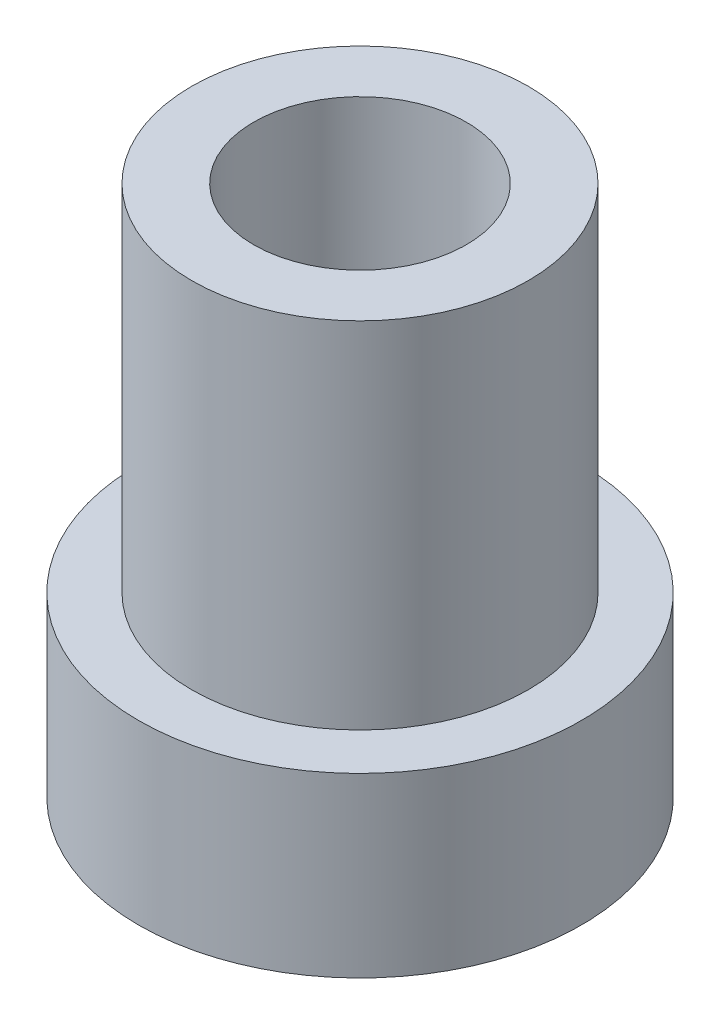
ISO-10303-21;
HEADER;
FILE_DESCRIPTION(('STEP AP214'),'2;1');
FILE_NAME('part.step','',(''),(''),'','','');
FILE_SCHEMA(('AUTOMOTIVE_DESIGN { 1 0 10303 214 1 1 1 1 }'));
ENDSEC;
DATA;
#1=APPLICATION_CONTEXT('core data for automotive mechanical design processes');
#2=APPLICATION_PROTOCOL_DEFINITION('international standard','automotive_design',2000,#1);
#3=PRODUCT_CONTEXT('',#1,'mechanical');
#4=PRODUCT('Part','Part','',(#3));
#5=PRODUCT_RELATED_PRODUCT_CATEGORY('part','',(#4));
#6=PRODUCT_DEFINITION_FORMATION('','',#4);
#7=PRODUCT_DEFINITION_CONTEXT('part definition',#1,'design');
#8=PRODUCT_DEFINITION('design','',#6,#7);
#9=PRODUCT_DEFINITION_SHAPE('','',#8);
#10=(LENGTH_UNIT() NAMED_UNIT(*) SI_UNIT(.MILLI.,.METRE.));
#11=(NAMED_UNIT(*) PLANE_ANGLE_UNIT() SI_UNIT($,.RADIAN.));
#12=(NAMED_UNIT(*) SI_UNIT($,.STERADIAN.) SOLID_ANGLE_UNIT());
#13=UNCERTAINTY_MEASURE_WITH_UNIT(LENGTH_MEASURE(1.E-05),#10,'distance_accuracy_value','');
#14=(GEOMETRIC_REPRESENTATION_CONTEXT(3) GLOBAL_UNCERTAINTY_ASSIGNED_CONTEXT((#13)) GLOBAL_UNIT_ASSIGNED_CONTEXT((#10,
#11,#12)) REPRESENTATION_CONTEXT('',''));
#15=CARTESIAN_POINT('',(0.,0.,0.));
#16=DIRECTION('',(0.,0.,1.));
#17=DIRECTION('',(1.,0.,0.));
#18=AXIS2_PLACEMENT_3D('',#15,#16,#17);
#19=CARTESIAN_POINT('',(0.,2.5,0.));
#20=DIRECTION('',(0.,1.,0.));
#21=DIRECTION('',(0.,0.,1.));
#22=AXIS2_PLACEMENT_3D('',#19,#20,#21);
#23=PLANE('',#22);
#24=CARTESIAN_POINT('',(0.,2.5,0.));
#25=DIRECTION('',(0.,1.,0.));
#26=DIRECTION('',(0.,0.,1.));
#27=AXIS2_PLACEMENT_3D('',#24,#25,#26);
#28=CIRCLE('',#27,6.25);
#29=CARTESIAN_POINT('',(0.,2.5,6.25));
#30=VERTEX_POINT('',#29);
#31=EDGE_CURVE('E98',#30,#30,#28,.T.);
#32=ORIENTED_EDGE('',*,*,#31,.T.);
#33=EDGE_LOOP('',(#32));
#34=FACE_BOUND('',#33,.T.);
#35=CARTESIAN_POINT('',(0.,2.5,0.));
#36=DIRECTION('',(0.,1.,0.));
#37=DIRECTION('',(0.,0.,1.));
#38=AXIS2_PLACEMENT_3D('',#35,#36,#37);
#39=CIRCLE('',#38,4.75);
#40=CARTESIAN_POINT('',(0.,2.5,4.75));
#41=VERTEX_POINT('',#40);
#42=EDGE_CURVE('E101',#41,#41,#39,.T.);
#43=ORIENTED_EDGE('',*,*,#42,.F.);
#44=EDGE_LOOP('',(#43));
#45=FACE_BOUND('',#44,.T.);
#46=ADVANCED_FACE('F31',(#34,#45),#23,.T.);
#47=CARTESIAN_POINT('',(0.,-2.5,0.));
#48=DIRECTION('',(0.,1.,0.));
#49=DIRECTION('',(0.,0.,1.));
#50=AXIS2_PLACEMENT_3D('',#47,#48,#49);
#51=CYLINDRICAL_SURFACE('',#50,6.25);
#52=CARTESIAN_POINT('',(-0.799999999999998,0.,-6.19858854901662));
#53=CARTESIAN_POINT('',(-0.799998103355052,0.0447384216622826,-6.19858920509883));
#54=CARTESIAN_POINT('',(-0.796234471583089,0.0895045855043547,-6.19907813068979));
#55=CARTESIAN_POINT('',(-0.781280467250262,0.177790427744555,-6.20098020115156));
#56=CARTESIAN_POINT('',(-0.770082391166254,0.221308764306667,-6.20239430466362));
#57=CARTESIAN_POINT('',(-0.740595585422706,0.305807971281473,-6.20598399602033));
#58=CARTESIAN_POINT('',(-0.722311737644266,0.346790566247948,-6.20815905948661));
#59=CARTESIAN_POINT('',(-0.679182972751172,0.425098400276179,-6.21302496530502));
#60=CARTESIAN_POINT('',(-0.654339152977227,0.46242424960159,-6.21571572137237));
#61=CARTESIAN_POINT('',(-0.598639726638125,0.532585288349308,-6.22132749335143));
#62=CARTESIAN_POINT('',(-0.56775332015891,0.565395938553753,-6.22424964125099));
#63=CARTESIAN_POINT('',(-0.500911802489199,0.625383157520279,-6.22998477347367));
#64=CARTESIAN_POINT('',(-0.464956436446921,0.652559442833896,-6.23279775229903));
#65=CARTESIAN_POINT('',(-0.388843043981081,0.700594824202452,-6.23800921634215));
#66=CARTESIAN_POINT('',(-0.348670862502126,0.721431664551834,-6.24040622887381));
#67=CARTESIAN_POINT('',(-0.265361571195449,0.756054095238485,-6.24450322898534));
#68=CARTESIAN_POINT('',(-0.222224576605874,0.769839959461727,-6.24620324363866));
#69=CARTESIAN_POINT('',(-0.134461363552115,0.78989565965155,-6.2487067283774));
#70=CARTESIAN_POINT('',(-0.0898446184998568,0.796206333423712,-6.24951506809975));
#71=CARTESIAN_POINT('',(-0.000178563831103555,0.801259104905367,-6.25016076076463));
#72=CARTESIAN_POINT('',(0.0448707279131788,0.80000151399262,-6.2499981536544));
#73=CARTESIAN_POINT('',(0.133845159087812,0.78998612710476,-6.24872420865018));
#74=CARTESIAN_POINT('',(0.177775333300913,0.781272252772466,-6.24761842670037));
#75=CARTESIAN_POINT('',(0.26354465032002,0.756660343950103,-6.24458861098289));
#76=CARTESIAN_POINT('',(0.305383751732842,0.740762167307911,-6.24266456102461));
#77=CARTESIAN_POINT('',(0.385918901333397,0.702186431235864,-6.23820482636099));
#78=CARTESIAN_POINT('',(0.424605774331072,0.679489921838115,-6.23566743587015));
#79=CARTESIAN_POINT('',(0.49763820524263,0.627975581400759,-6.23026478130117));
#80=CARTESIAN_POINT('',(0.53198355429771,0.599157456045633,-6.22739950146179));
#81=CARTESIAN_POINT('',(0.595616134646156,0.535972070643326,-6.22163736995005));
#82=CARTESIAN_POINT('',(0.624865354771136,0.501566524418464,-6.21874043917224));
#83=CARTESIAN_POINT('',(0.677179822101734,0.42831430524855,-6.2132617470842));
#84=CARTESIAN_POINT('',(0.700245048185655,0.389467617135233,-6.21067998685047));
#85=CARTESIAN_POINT('',(0.739539289986804,0.308401324610993,-6.20612399249395));
#86=CARTESIAN_POINT('',(0.755765165574465,0.266180181456947,-6.20415003754274));
#87=CARTESIAN_POINT('',(0.780885905649601,0.17958150973,-6.20103853372848));
#88=CARTESIAN_POINT('',(0.789781141229998,0.135204090432929,-6.19990094252718));
#89=CARTESIAN_POINT('',(0.799937560637435,0.0458885645932327,-6.19859874267202));
#90=CARTESIAN_POINT('',(0.80125228095606,0.000956641635407121,-6.19842731082682));
#91=CARTESIAN_POINT('',(0.796351695747611,-0.0884868285649509,-6.19905878667995));
#92=CARTESIAN_POINT('',(0.790136558721648,-0.132998385191864,-6.19986167257526));
#93=CARTESIAN_POINT('',(0.770397797314314,-0.220176568162875,-6.20234508806591));
#94=CARTESIAN_POINT('',(0.756900179018527,-0.262849179440258,-6.20402249399469));
#95=CARTESIAN_POINT('',(0.723006404263422,-0.345325552666033,-6.20806341076657));
#96=CARTESIAN_POINT('',(0.702609994319167,-0.385129209134123,-6.21042694681996));
#97=CARTESIAN_POINT('',(0.655366319104514,-0.460979763177237,-6.21559012728318));
#98=CARTESIAN_POINT('',(0.628483995817668,-0.497004662895021,-6.21839211165469));
#99=CARTESIAN_POINT('',(0.569081051422917,-0.564050452374765,-6.22410916255449));
#100=CARTESIAN_POINT('',(0.536560200123168,-0.595071137740769,-6.22702423369575));
#101=CARTESIAN_POINT('',(0.466569266179765,-0.651416465040394,-6.23266000344565));
#102=CARTESIAN_POINT('',(0.429070719390191,-0.676705894473667,-6.23537943391895));
#103=CARTESIAN_POINT('',(0.350326980977994,-0.720627002393255,-6.24029847252802));
#104=CARTESIAN_POINT('',(0.309081868017037,-0.739258820620069,-6.24249809157409));
#105=CARTESIAN_POINT('',(0.224132017906611,-0.769277877112732,-6.24612404918944));
#106=CARTESIAN_POINT('',(0.180434524800401,-0.780685343630966,-6.24755254523759));
#107=CARTESIAN_POINT('',(0.0917248691272082,-0.795997650606327,-6.24948427412541));
#108=CARTESIAN_POINT('',(0.046712768973737,-0.799902846662313,-6.24998755081937));
#109=CARTESIAN_POINT('',(-0.0430048083926901,-0.800092888538515,-6.25001190319));
#110=CARTESIAN_POINT('',(-0.0877101784763456,-0.796431983214026,-6.24953997110546));
#111=CARTESIAN_POINT('',(-0.17586465917414,-0.781708791545258,-6.24768085214323));
#112=CARTESIAN_POINT('',(-0.219313770963546,-0.770646512125421,-6.24629366612181));
#113=CARTESIAN_POINT('',(-0.303714392005289,-0.741451877837967,-6.24275920188162));
#114=CARTESIAN_POINT('',(-0.344666858289615,-0.723322252033565,-6.24061221708941));
#115=CARTESIAN_POINT('',(-0.422956789361968,-0.680513185462864,-6.23579567687036));
#116=CARTESIAN_POINT('',(-0.460294202731866,-0.655833651553664,-6.23312611401235));
#117=CARTESIAN_POINT('',(-0.53057111333578,-0.600425087547363,-6.22753943854455));
#118=CARTESIAN_POINT('',(-0.563478682462198,-0.569655717781125,-6.22462075331536));
#119=CARTESIAN_POINT('',(-0.623684422036376,-0.503024925894422,-6.21887729846471));
#120=CARTESIAN_POINT('',(-0.65098126374913,-0.467162300979386,-6.21605255122213));
#121=CARTESIAN_POINT('',(-0.699285837169648,-0.391195896147679,-6.21080460500523));
#122=CARTESIAN_POINT('',(-0.720267663867247,-0.35107553605646,-6.20838307774624));
#123=CARTESIAN_POINT('',(-0.755165924534618,-0.267871742201827,-6.20423533001094));
#124=CARTESIAN_POINT('',(-0.769090004253182,-0.22479157255845,-6.2025083575353));
#125=CARTESIAN_POINT('',(-0.786162981242654,-0.15124293526623,-6.20036235008673));
#126=CARTESIAN_POINT('',(-0.791344349660192,-0.121237413020004,-6.19970051072003));
#127=CARTESIAN_POINT('',(-0.798263489871271,-0.0608255335134214,-6.19881338890895));
#128=CARTESIAN_POINT('',(-0.800001289593617,-0.0304191795059932,-6.19858810292394));
#129=CARTESIAN_POINT('',(-0.799999999999998,0.,-6.19858854901662));
#130=B_SPLINE_CURVE_WITH_KNOTS('',3,(#52,#53,#54,#55,#56,#57,#58,#59,#60,#61,#62,#63,#64,#65,
#66,#67,#68,#69,#70,#71,#72,#73,#74,#75,#76,#77,#78,#79,#80,#81,#82,#83,#84,#85,#86,#87,#88,#89,
#90,#91,#92,#93,#94,#95,#96,#97,#98,#99,#100,#101,#102,#103,#104,#105,#106,#107,#108,#109,#110,
#111,#112,#113,#114,#115,#116,#117,#118,#119,#120,#121,#122,#123,#124,#125,#126,#127,#128,#129),
.UNSPECIFIED.,.T.,.F.,(4,2,2,2,2,2,2,2,2,2,2,2,2,2,2,2,2,2,2,2,2,2,2,2,2,2,2,2,2,2,2,2,2,2,2,2,
2,2,4),(0.,0.134104132368558,0.268347439905362,0.402498421845213,0.536626977442864,
0.671457907324828,0.806295618512648,0.941601378879694,1.07690188307166,1.21145976537299,
1.34601211165683,1.47977728364873,1.61354510249969,1.74768931751825,1.88183998339294,
2.01695199733597,2.15206447275403,2.28723891454726,2.4224065130962,2.55661832598568,
2.69082713557497,2.82455982096353,2.95829742067709,3.092774772505,3.22725761563873,
3.36254557159521,3.49783068774678,3.63273530973733,3.76763353724853,3.90156790235245,
4.03550214215267,4.16938471425588,4.30326919033684,4.43807214989299,4.57290699685859,
4.70828764282704,4.84352131404857,4.93470402924072,5.02588600489933),.UNSPECIFIED.);
#131=CARTESIAN_POINT('',(-0.799999999999998,0.,-6.19858854901662));
#132=VERTEX_POINT('',#131);
#133=EDGE_CURVE('E72',#132,#132,#130,.T.);
#134=ORIENTED_EDGE('',*,*,#133,.F.);
#135=EDGE_LOOP('',(#134));
#136=FACE_BOUND('',#135,.T.);
#137=CARTESIAN_POINT('',(-6.19858854901662,0.,0.799999999999998));
#138=CARTESIAN_POINT('',(-6.19858920509883,0.0447384216622826,0.799998103355052));
#139=CARTESIAN_POINT('',(-6.19907813068979,0.0895045855043546,0.796234471583089));
#140=CARTESIAN_POINT('',(-6.20098020115156,0.177790427744555,0.781280467250262));
#141=CARTESIAN_POINT('',(-6.20239430466362,0.221308764306667,0.770082391166254));
#142=CARTESIAN_POINT('',(-6.20598399602033,0.305807971281473,0.740595585422706));
#143=CARTESIAN_POINT('',(-6.20815905948661,0.346790566247948,0.722311737644266));
#144=CARTESIAN_POINT('',(-6.21302496530502,0.425098400276179,0.679182972751172));
#145=CARTESIAN_POINT('',(-6.21571572137237,0.46242424960159,0.654339152977227));
#146=CARTESIAN_POINT('',(-6.22132749335143,0.532585288349308,0.598639726638125));
#147=CARTESIAN_POINT('',(-6.22424964125099,0.565395938553753,0.56775332015891));
#148=CARTESIAN_POINT('',(-6.22998477347367,0.625383157520279,0.500911802489199));
#149=CARTESIAN_POINT('',(-6.23279775229903,0.652559442833896,0.464956436446921));
#150=CARTESIAN_POINT('',(-6.23800921634215,0.700594824202452,0.388843043981081));
#151=CARTESIAN_POINT('',(-6.24040622887381,0.721431664551834,0.348670862502126));
#152=CARTESIAN_POINT('',(-6.24450322898534,0.756054095238485,0.265361571195449));
#153=CARTESIAN_POINT('',(-6.24620324363866,0.769839959461727,0.222224576605874));
#154=CARTESIAN_POINT('',(-6.2487067283774,0.78989565965155,0.134461363552115));
#155=CARTESIAN_POINT('',(-6.24951506809975,0.796206333423712,0.0898446184998568));
#156=CARTESIAN_POINT('',(-6.25016076076463,0.801259104905367,0.000178563831103555));
#157=CARTESIAN_POINT('',(-6.2499981536544,0.80000151399262,-0.0448707279131788));
#158=CARTESIAN_POINT('',(-6.24872420865018,0.78998612710476,-0.133845159087812));
#159=CARTESIAN_POINT('',(-6.24761842670037,0.781272252772466,-0.177775333300913));
#160=CARTESIAN_POINT('',(-6.24458861098289,0.756660343950103,-0.26354465032002));
#161=CARTESIAN_POINT('',(-6.24266456102461,0.740762167307911,-0.305383751732842));
#162=CARTESIAN_POINT('',(-6.23820482636099,0.702186431235864,-0.385918901333397));
#163=CARTESIAN_POINT('',(-6.23566743587015,0.679489921838115,-0.424605774331072));
#164=CARTESIAN_POINT('',(-6.23026478130117,0.627975581400759,-0.49763820524263));
#165=CARTESIAN_POINT('',(-6.22739950146179,0.599157456045633,-0.53198355429771));
#166=CARTESIAN_POINT('',(-6.22163736995005,0.535972070643326,-0.595616134646156));
#167=CARTESIAN_POINT('',(-6.21874043917224,0.501566524418464,-0.624865354771136));
#168=CARTESIAN_POINT('',(-6.2132617470842,0.42831430524855,-0.677179822101734));
#169=CARTESIAN_POINT('',(-6.21067998685047,0.389467617135233,-0.700245048185655));
#170=CARTESIAN_POINT('',(-6.20612399249395,0.308401324610993,-0.739539289986804));
#171=CARTESIAN_POINT('',(-6.20415003754274,0.266180181456947,-0.755765165574465));
#172=CARTESIAN_POINT('',(-6.20103853372848,0.17958150973,-0.780885905649601));
#173=CARTESIAN_POINT('',(-6.19990094252718,0.135204090432929,-0.789781141229998));
#174=CARTESIAN_POINT('',(-6.19859874267202,0.0458885645932327,-0.799937560637435));
#175=CARTESIAN_POINT('',(-6.19842731082682,0.000956641635407067,-0.80125228095606));
#176=CARTESIAN_POINT('',(-6.19905878667995,-0.088486828564951,-0.796351695747611));
#177=CARTESIAN_POINT('',(-6.19986167257526,-0.132998385191864,-0.790136558721648));
#178=CARTESIAN_POINT('',(-6.20234508806591,-0.220176568162876,-0.770397797314314));
#179=CARTESIAN_POINT('',(-6.20402249399469,-0.262849179440258,-0.756900179018527));
#180=CARTESIAN_POINT('',(-6.20806341076657,-0.345325552666033,-0.723006404263422));
#181=CARTESIAN_POINT('',(-6.21042694681996,-0.385129209134123,-0.702609994319167));
#182=CARTESIAN_POINT('',(-6.21559012728318,-0.460979763177237,-0.655366319104514));
#183=CARTESIAN_POINT('',(-6.2183921116547,-0.497004662895021,-0.628483995817668));
#184=CARTESIAN_POINT('',(-6.2241091625545,-0.564050452374765,-0.569081051422917));
#185=CARTESIAN_POINT('',(-6.22702423369575,-0.595071137740769,-0.536560200123168));
#186=CARTESIAN_POINT('',(-6.23266000344565,-0.651416465040394,-0.466569266179765));
#187=CARTESIAN_POINT('',(-6.23537943391895,-0.676705894473667,-0.429070719390191));
#188=CARTESIAN_POINT('',(-6.24029847252802,-0.720627002393255,-0.350326980977995));
#189=CARTESIAN_POINT('',(-6.24249809157409,-0.739258820620069,-0.309081868017037));
#190=CARTESIAN_POINT('',(-6.24612404918944,-0.769277877112732,-0.224132017906611));
#191=CARTESIAN_POINT('',(-6.24755254523759,-0.780685343630966,-0.180434524800402));
#192=CARTESIAN_POINT('',(-6.24948427412541,-0.795997650606327,-0.0917248691272082));
#193=CARTESIAN_POINT('',(-6.24998755081937,-0.799902846662313,-0.0467127689737369));
#194=CARTESIAN_POINT('',(-6.25001190319,-0.800092888538515,0.0430048083926901));
#195=CARTESIAN_POINT('',(-6.24953997110546,-0.796431983214026,0.0877101784763455));
#196=CARTESIAN_POINT('',(-6.24768085214323,-0.781708791545258,0.17586465917414));
#197=CARTESIAN_POINT('',(-6.24629366612181,-0.770646512125421,0.219313770963546));
#198=CARTESIAN_POINT('',(-6.24275920188162,-0.741451877837967,0.303714392005289));
#199=CARTESIAN_POINT('',(-6.24061221708941,-0.723322252033565,0.344666858289616));
#200=CARTESIAN_POINT('',(-6.23579567687036,-0.680513185462864,0.422956789361968));
#201=CARTESIAN_POINT('',(-6.23312611401235,-0.655833651553664,0.460294202731866));
#202=CARTESIAN_POINT('',(-6.22753943854455,-0.600425087547362,0.53057111333578));
#203=CARTESIAN_POINT('',(-6.22462075331536,-0.569655717781125,0.563478682462198));
#204=CARTESIAN_POINT('',(-6.21887729846471,-0.503024925894422,0.623684422036377));
#205=CARTESIAN_POINT('',(-6.21605255122213,-0.467162300979386,0.650981263749131));
#206=CARTESIAN_POINT('',(-6.21080460500523,-0.391195896147679,0.699285837169649));
#207=CARTESIAN_POINT('',(-6.20838307774624,-0.351075536056459,0.720267663867247));
#208=CARTESIAN_POINT('',(-6.20423533001094,-0.267871742201827,0.755165924534618));
#209=CARTESIAN_POINT('',(-6.2025083575353,-0.22479157255845,0.769090004253182));
#210=CARTESIAN_POINT('',(-6.20036235008673,-0.15124293526623,0.786162981242654));
#211=CARTESIAN_POINT('',(-6.19970051072003,-0.121237413020005,0.791344349660192));
#212=CARTESIAN_POINT('',(-6.19881338890895,-0.0608255335134219,0.798263489871271));
#213=CARTESIAN_POINT('',(-6.19858810292394,-0.0304191795059934,0.800001289593617));
#214=CARTESIAN_POINT('',(-6.19858854901662,0.,0.799999999999998));
#215=B_SPLINE_CURVE_WITH_KNOTS('',3,(#137,#138,#139,#140,#141,#142,#143,#144,#145,#146,#147,
#148,#149,#150,#151,#152,#153,#154,#155,#156,#157,#158,#159,#160,#161,#162,#163,#164,#165,#166,
#167,#168,#169,#170,#171,#172,#173,#174,#175,#176,#177,#178,#179,#180,#181,#182,#183,#184,#185,
#186,#187,#188,#189,#190,#191,#192,#193,#194,#195,#196,#197,#198,#199,#200,#201,#202,#203,#204,
#205,#206,#207,#208,#209,#210,#211,#212,#213,#214),.UNSPECIFIED.,.T.,.F.,(4,2,2,2,2,2,2,2,2,2,2,
2,2,2,2,2,2,2,2,2,2,2,2,2,2,2,2,2,2,2,2,2,2,2,2,2,2,2,4),(0.,0.134104132368558,
0.268347439905362,0.402498421845213,0.536626977442864,0.671457907324828,0.806295618512648,
0.941601378879694,1.07690188307166,1.21145976537299,1.34601211165683,1.47977728364873,
1.61354510249969,1.74768931751825,1.88183998339294,2.01695199733597,2.15206447275403,
2.28723891454726,2.4224065130962,2.55661832598568,2.69082713557497,2.82455982096353,
2.95829742067709,3.092774772505,3.22725761563873,3.36254557159521,3.49783068774678,
3.63273530973733,3.76763353724853,3.90156790235245,4.03550214215267,4.16938471425588,
4.30326919033684,4.43807214989299,4.57290699685859,4.70828764282704,4.84352131404857,
4.93470402924072,5.02588600489933),.UNSPECIFIED.);
#216=CARTESIAN_POINT('',(-6.19858854901662,0.,0.799999999999998));
#217=VERTEX_POINT('',#216);
#218=EDGE_CURVE('E10',#217,#217,#215,.T.);
#219=ORIENTED_EDGE('',*,*,#218,.F.);
#220=EDGE_LOOP('',(#219));
#221=FACE_BOUND('',#220,.T.);
#222=CARTESIAN_POINT('',(0.,-2.5,0.));
#223=DIRECTION('',(0.,1.,0.));
#224=DIRECTION('',(0.,0.,1.));
#225=AXIS2_PLACEMENT_3D('',#222,#223,#224);
#226=CIRCLE('',#225,6.25);
#227=CARTESIAN_POINT('',(0.,-2.5,6.25));
#228=VERTEX_POINT('',#227);
#229=EDGE_CURVE('E44',#228,#228,#226,.T.);
#230=ORIENTED_EDGE('',*,*,#229,.T.);
#231=EDGE_LOOP('',(#230));
#232=FACE_BOUND('',#231,.T.);
#233=ORIENTED_EDGE('',*,*,#31,.F.);
#234=EDGE_LOOP('',(#233));
#235=FACE_BOUND('',#234,.T.);
#236=ADVANCED_FACE('F33',(#136,#221,#232,#235),#51,.T.);
#237=CARTESIAN_POINT('',(0.,-2.5,0.));
#238=DIRECTION('',(0.,1.,0.));
#239=DIRECTION('',(0.,0.,1.));
#240=AXIS2_PLACEMENT_3D('',#237,#238,#239);
#241=PLANE('',#240);
#242=CARTESIAN_POINT('',(0.,-2.5,0.));
#243=DIRECTION('',(0.,1.,0.));
#244=DIRECTION('',(0.,0.,1.));
#245=AXIS2_PLACEMENT_3D('',#242,#243,#244);
#246=CIRCLE('',#245,3.);
#247=CARTESIAN_POINT('',(0.,-2.5,3.));
#248=VERTEX_POINT('',#247);
#249=EDGE_CURVE('E48',#248,#248,#246,.T.);
#250=ORIENTED_EDGE('',*,*,#249,.T.);
#251=EDGE_LOOP('',(#250));
#252=FACE_BOUND('',#251,.T.);
#253=ORIENTED_EDGE('',*,*,#229,.F.);
#254=EDGE_LOOP('',(#253));
#255=FACE_BOUND('',#254,.T.);
#256=ADVANCED_FACE('F80',(#252,#255),#241,.F.);
#257=CARTESIAN_POINT('',(0.,-2.5,0.));
#258=DIRECTION('',(0.,1.,0.));
#259=DIRECTION('',(0.,0.,1.));
#260=AXIS2_PLACEMENT_3D('',#257,#258,#259);
#261=CYLINDRICAL_SURFACE('',#260,3.);
#262=CARTESIAN_POINT('',(-0.799999999999998,0.,-2.89136645896019));
#263=CARTESIAN_POINT('',(-0.799998937264902,0.0440703750839192,-2.89136722297506));
#264=CARTESIAN_POINT('',(-0.796345972907144,0.0881520001552148,-2.89238505896883));
#265=CARTESIAN_POINT('',(-0.781858333049021,0.175042168590237,-2.89633424540265));
#266=CARTESIAN_POINT('',(-0.771020054484959,0.217850061984803,-2.89926655584147));
#267=CARTESIAN_POINT('',(-0.742543382237439,0.300923227990093,-2.90668950049836));
#268=CARTESIAN_POINT('',(-0.724914550167944,0.341191983534422,-2.91117794268077));
#269=CARTESIAN_POINT('',(-0.683387138255578,0.418206696020877,-2.92120461973766));
#270=CARTESIAN_POINT('',(-0.659488071366004,0.454952379001967,-2.92674293615287));
#271=CARTESIAN_POINT('',(-0.605459391498025,0.524797018795931,-2.93840055819835));
#272=CARTESIAN_POINT('',(-0.575201190016775,0.55779480698601,-2.94453016446161));
#273=CARTESIAN_POINT('',(-0.509589709136139,0.618312630780252,-2.95659080575019));
#274=CARTESIAN_POINT('',(-0.474235902138672,0.645832098456655,-2.96252182013488));
#275=CARTESIAN_POINT('',(-0.398735268349291,0.695033975361231,-2.97363195387253));
#276=CARTESIAN_POINT('',(-0.358520727951787,0.716615807453158,-2.97879750504887));
#277=CARTESIAN_POINT('',(-0.274873217891639,0.752673854146885,-2.98767650484764));
#278=CARTESIAN_POINT('',(-0.231440792350042,0.767151266912617,-2.99139019830513));
#279=CARTESIAN_POINT('',(-0.143646384724034,0.78826208809431,-2.99687421430577));
#280=CARTESIAN_POINT('',(-0.0993284896803655,0.795067590650366,-2.99868710700104));
#281=CARTESIAN_POINT('',(-0.0101454214034301,0.801182848042868,-3.00031409847102));
#282=CARTESIAN_POINT('',(0.0347196589754122,0.800493857452054,-3.00012853178644));
#283=CARTESIAN_POINT('',(0.122525694844539,0.79176087498421,-2.99781070343906));
#284=CARTESIAN_POINT('',(0.165486640288444,0.783902816945482,-2.99572765610801));
#285=CARTESIAN_POINT('',(0.249456526228422,0.761355144887219,-2.98990699436187));
#286=CARTESIAN_POINT('',(0.290465355272232,0.746665141325581,-2.98616928560231));
#287=CARTESIAN_POINT('',(0.369841578059021,0.710728060963046,-2.97738627639961));
#288=CARTESIAN_POINT('',(0.408178674531815,0.689417277159717,-2.97232835151085));
#289=CARTESIAN_POINT('',(0.480795999505805,0.640892472196361,-2.96144987403785));
#290=CARTESIAN_POINT('',(0.515075435234343,0.613677300388731,-2.95562917289137));
#291=CARTESIAN_POINT('',(0.579714147786243,0.55312925682643,-2.94364509175552));
#292=CARTESIAN_POINT('',(0.609920768071096,0.519634221980241,-2.93747667747739));
#293=CARTESIAN_POINT('',(0.664325328419074,0.447990129504487,-2.92565362009165));
#294=CARTESIAN_POINT('',(0.688522902119218,0.409840788319875,-2.91999900832316));
#295=CARTESIAN_POINT('',(0.730338716745106,0.329639959271421,-2.90982360913227));
#296=CARTESIAN_POINT('',(0.747915466402144,0.287565859634532,-2.90531002840292));
#297=CARTESIAN_POINT('',(0.775696006742652,0.200909400218218,-2.89801730031578));
#298=CARTESIAN_POINT('',(0.785901625845208,0.156327665420632,-2.89523772285943));
#299=CARTESIAN_POINT('',(0.798387028371088,0.0673491155913535,-2.89181934257617));
#300=CARTESIAN_POINT('',(0.800894530484869,0.022986580555709,-2.89111905331079));
#301=CARTESIAN_POINT('',(0.798539924491999,-0.0655239091209873,-2.89177031401857));
#302=CARTESIAN_POINT('',(0.793678600688864,-0.109671886096884,-2.89312164562678));
#303=CARTESIAN_POINT('',(0.776925087479653,-0.195622637639039,-2.89766449715693));
#304=CARTESIAN_POINT('',(0.765169791651625,-0.237454175175541,-2.90082015876541));
#305=CARTESIAN_POINT('',(0.735115946901956,-0.318551852543324,-2.90858107584293));
#306=CARTESIAN_POINT('',(0.716816543506618,-0.357817656570795,-2.91318652060286));
#307=CARTESIAN_POINT('',(0.673731622034808,-0.433621982974264,-2.92345428988314));
#308=CARTESIAN_POINT('',(0.648812380951691,-0.470081590355941,-2.9291376194891));
#309=CARTESIAN_POINT('',(0.593360911950062,-0.538385320681214,-2.94087136773703));
#310=CARTESIAN_POINT('',(0.562827628891866,-0.570228573981645,-2.94692185524159));
#311=CARTESIAN_POINT('',(0.495961513001934,-0.62934098929998,-2.95891985953716));
#312=CARTESIAN_POINT('',(0.459486566403537,-0.656451350791435,-2.96485934609522));
#313=CARTESIAN_POINT('',(0.382371374376296,-0.704164394964202,-2.97578668006869));
#314=CARTESIAN_POINT('',(0.341731350807553,-0.724767424031565,-2.98077457813166));
#315=CARTESIAN_POINT('',(0.257725653930348,-0.758691852944603,-2.989204603597));
#316=CARTESIAN_POINT('',(0.214383141152933,-0.772067607777386,-2.99265823392154));
#317=CARTESIAN_POINT('',(0.125959753892528,-0.791315491225744,-2.99768121514899));
#318=CARTESIAN_POINT('',(0.0808792669280992,-0.797189282709874,-2.99925098361988));
#319=CARTESIAN_POINT('',(-0.00825680053846279,-0.80116232949657,-3.0003096537508));
#320=CARTESIAN_POINT('',(-0.0523014046111553,-0.799494527652454,-2.99986090515247));
#321=CARTESIAN_POINT('',(-0.139459321852278,-0.788972602569928,-2.9970739639153));
#322=CARTESIAN_POINT('',(-0.182572669925092,-0.78011874915323,-2.99473584221861));
#323=CARTESIAN_POINT('',(-0.266364049385718,-0.755607758032508,-2.98844524156423));
#324=CARTESIAN_POINT('',(-0.307056804740742,-0.739997882610835,-2.9845039887589));
#325=CARTESIAN_POINT('',(-0.385268839388416,-0.70246015930169,-2.975419266064));
#326=CARTESIAN_POINT('',(-0.422787672664391,-0.680531425355573,-2.97027562758962));
#327=CARTESIAN_POINT('',(-0.494671307469949,-0.630296691144469,-2.95916532490407));
#328=CARTESIAN_POINT('',(-0.52892534469514,-0.601836247717817,-2.9531803735152));
#329=CARTESIAN_POINT('',(-0.592250148622715,-0.539638900256754,-2.94113600028035));
#330=CARTESIAN_POINT('',(-0.621319548965408,-0.505900609682412,-2.93507655925178));
#331=CARTESIAN_POINT('',(-0.674082800936313,-0.433212641663775,-2.92341583866508));
#332=CARTESIAN_POINT('',(-0.697644377069545,-0.394164674500526,-2.91782756531166));
#333=CARTESIAN_POINT('',(-0.737834756144799,-0.312517475618617,-2.90792557601371));
#334=CARTESIAN_POINT('',(-0.754468093475428,-0.269920588573625,-2.90361102698333));
#335=CARTESIAN_POINT('',(-0.778152497005276,-0.189567465586797,-2.89734400254551));
#336=CARTESIAN_POINT('',(-0.786326073597102,-0.152159494180561,-2.89512056111167));
#337=CARTESIAN_POINT('',(-0.79724997717637,-0.0765037767991644,-2.8921315408234));
#338=CARTESIAN_POINT('',(-0.800000922527406,-0.0382561270787818,-2.89136579574256));
#339=CARTESIAN_POINT('',(-0.799999999999998,0.,-2.89136645896019));
#340=B_SPLINE_CURVE_WITH_KNOTS('',3,(#262,#263,#264,#265,#266,#267,#268,#269,#270,#271,#272,
#273,#274,#275,#276,#277,#278,#279,#280,#281,#282,#283,#284,#285,#286,#287,#288,#289,#290,#291,
#292,#293,#294,#295,#296,#297,#298,#299,#300,#301,#302,#303,#304,#305,#306,#307,#308,#309,#310,
#311,#312,#313,#314,#315,#316,#317,#318,#319,#320,#321,#322,#323,#324,#325,#326,#327,#328,#329,
#330,#331,#332,#333,#334,#335,#336,#337,#338,#339),.UNSPECIFIED.,.T.,.F.,(4,2,2,2,2,2,2,2,2,2,2,
2,2,2,2,2,2,2,2,2,2,2,2,2,2,2,2,2,2,2,2,2,2,2,2,2,2,2,4),(0.,0.132070451229522,
0.264207179107366,0.396158524605752,0.528120122591703,0.663063664488128,0.798021188465129,
0.935140829450497,1.07223733718427,1.2061932172332,1.34012667350969,1.4706822831705,
1.60124533773006,1.73310579558956,1.86499197354525,2.0009270491686,2.1368704105256,
2.27365206035343,2.41039976964131,2.54306133692496,2.67570878532057,2.80580740167686,
2.93592301140585,3.06889853981765,3.20189908611245,3.33874362778509,3.47558088397897,
3.61137415831216,3.74713732778258,3.87873621961241,4.0103301703984,4.14101805942122,
4.27172428301041,4.40591541591286,4.54014186147074,4.67732015588441,4.81440852834153,
4.92906787062242,5.04371413709888),.UNSPECIFIED.);
#341=CARTESIAN_POINT('',(-0.799999999999998,0.,-2.89136645896019));
#342=VERTEX_POINT('',#341);
#343=EDGE_CURVE('E36',#342,#342,#340,.T.);
#344=ORIENTED_EDGE('',*,*,#343,.T.);
#345=EDGE_LOOP('',(#344));
#346=FACE_BOUND('',#345,.T.);
#347=CARTESIAN_POINT('',(-2.89136645896019,0.,0.799999999999999));
#348=CARTESIAN_POINT('',(-2.89136722297506,0.0440703750839192,0.799998937264903));
#349=CARTESIAN_POINT('',(-2.89238505896883,0.0881520001552148,0.796345972907145));
#350=CARTESIAN_POINT('',(-2.89633424540265,0.175042168590237,0.781858333049021));
#351=CARTESIAN_POINT('',(-2.89926655584147,0.217850061984803,0.77102005448496));
#352=CARTESIAN_POINT('',(-2.90668950049836,0.300923227990093,0.742543382237439));
#353=CARTESIAN_POINT('',(-2.91117794268077,0.341191983534422,0.724914550167944));
#354=CARTESIAN_POINT('',(-2.92120461973766,0.418206696020877,0.683387138255578));
#355=CARTESIAN_POINT('',(-2.92674293615287,0.454952379001967,0.659488071366005));
#356=CARTESIAN_POINT('',(-2.93840055819835,0.524797018795931,0.605459391498025));
#357=CARTESIAN_POINT('',(-2.94453016446161,0.55779480698601,0.575201190016776));
#358=CARTESIAN_POINT('',(-2.95659080575019,0.618312630780252,0.50958970913614));
#359=CARTESIAN_POINT('',(-2.96252182013488,0.645832098456655,0.474235902138672));
#360=CARTESIAN_POINT('',(-2.97363195387253,0.695033975361231,0.398735268349292));
#361=CARTESIAN_POINT('',(-2.97879750504887,0.716615807453157,0.358520727951787));
#362=CARTESIAN_POINT('',(-2.98767650484764,0.752673854146884,0.27487321789164));
#363=CARTESIAN_POINT('',(-2.99139019830513,0.767151266912617,0.231440792350042));
#364=CARTESIAN_POINT('',(-2.99687421430577,0.78826208809431,0.143646384724035));
#365=CARTESIAN_POINT('',(-2.99868710700104,0.795067590650366,0.0993284896803661));
#366=CARTESIAN_POINT('',(-3.00031409847102,0.801182848042868,0.0101454214034306));
#367=CARTESIAN_POINT('',(-3.00012853178644,0.800493857452054,-0.0347196589754116));
#368=CARTESIAN_POINT('',(-2.99781070343906,0.79176087498421,-0.122525694844538));
#369=CARTESIAN_POINT('',(-2.99572765610801,0.783902816945482,-0.165486640288444));
#370=CARTESIAN_POINT('',(-2.98990699436187,0.761355144887219,-0.249456526228421));
#371=CARTESIAN_POINT('',(-2.98616928560231,0.746665141325581,-0.290465355272231));
#372=CARTESIAN_POINT('',(-2.97738627639961,0.710728060963046,-0.369841578059021));
#373=CARTESIAN_POINT('',(-2.97232835151085,0.689417277159717,-0.408178674531815));
#374=CARTESIAN_POINT('',(-2.96144987403785,0.640892472196361,-0.480795999505805));
#375=CARTESIAN_POINT('',(-2.95562917289138,0.613677300388731,-0.515075435234342));
#376=CARTESIAN_POINT('',(-2.94364509175552,0.55312925682643,-0.579714147786242));
#377=CARTESIAN_POINT('',(-2.93747667747739,0.519634221980241,-0.609920768071095));
#378=CARTESIAN_POINT('',(-2.92565362009165,0.447990129504487,-0.664325328419074));
#379=CARTESIAN_POINT('',(-2.91999900832316,0.409840788319875,-0.688522902119218));
#380=CARTESIAN_POINT('',(-2.90982360913227,0.329639959271421,-0.730338716745105));
#381=CARTESIAN_POINT('',(-2.90531002840292,0.287565859634532,-0.747915466402143));
#382=CARTESIAN_POINT('',(-2.89801730031578,0.200909400218218,-0.775696006742652));
#383=CARTESIAN_POINT('',(-2.89523772285943,0.156327665420632,-0.785901625845207));
#384=CARTESIAN_POINT('',(-2.89181934257617,0.0673491155913535,-0.798387028371087));
#385=CARTESIAN_POINT('',(-2.89111905331079,0.022986580555709,-0.800894530484868));
#386=CARTESIAN_POINT('',(-2.89177031401857,-0.0655239091209874,-0.798539924491998));
#387=CARTESIAN_POINT('',(-2.89312164562678,-0.109671886096884,-0.793678600688863));
#388=CARTESIAN_POINT('',(-2.89766449715693,-0.195622637639039,-0.776925087479652));
#389=CARTESIAN_POINT('',(-2.90082015876541,-0.237454175175541,-0.765169791651624));
#390=CARTESIAN_POINT('',(-2.90858107584293,-0.318551852543324,-0.735115946901956));
#391=CARTESIAN_POINT('',(-2.91318652060286,-0.357817656570795,-0.716816543506618));
#392=CARTESIAN_POINT('',(-2.92345428988314,-0.433621982974264,-0.673731622034808));
#393=CARTESIAN_POINT('',(-2.9291376194891,-0.470081590355941,-0.64881238095169));
#394=CARTESIAN_POINT('',(-2.94087136773703,-0.538385320681214,-0.593360911950061));
#395=CARTESIAN_POINT('',(-2.94692185524159,-0.570228573981646,-0.562827628891864));
#396=CARTESIAN_POINT('',(-2.95891985953717,-0.62934098929998,-0.495961513001933));
#397=CARTESIAN_POINT('',(-2.96485934609522,-0.656451350791435,-0.459486566403536));
#398=CARTESIAN_POINT('',(-2.97578668006869,-0.704164394964202,-0.382371374376296));
#399=CARTESIAN_POINT('',(-2.98077457813166,-0.724767424031565,-0.341731350807552));
#400=CARTESIAN_POINT('',(-2.989204603597,-0.758691852944603,-0.257725653930347));
#401=CARTESIAN_POINT('',(-2.99265823392154,-0.772067607777386,-0.214383141152933));
#402=CARTESIAN_POINT('',(-2.99768121514899,-0.791315491225744,-0.125959753892527));
#403=CARTESIAN_POINT('',(-2.99925098361988,-0.797189282709874,-0.0808792669280986));
#404=CARTESIAN_POINT('',(-3.0003096537508,-0.801162329496569,0.00825680053846319));
#405=CARTESIAN_POINT('',(-2.99986090515247,-0.799494527652454,0.0523014046111556));
#406=CARTESIAN_POINT('',(-2.9970739639153,-0.788972602569928,0.139459321852279));
#407=CARTESIAN_POINT('',(-2.99473584221861,-0.78011874915323,0.182572669925092));
#408=CARTESIAN_POINT('',(-2.98844524156423,-0.755607758032508,0.266364049385718));
#409=CARTESIAN_POINT('',(-2.9845039887589,-0.739997882610835,0.307056804740742));
#410=CARTESIAN_POINT('',(-2.975419266064,-0.70246015930169,0.385268839388416));
#411=CARTESIAN_POINT('',(-2.97027562758962,-0.680531425355573,0.422787672664392));
#412=CARTESIAN_POINT('',(-2.95916532490407,-0.63029669114447,0.494671307469949));
#413=CARTESIAN_POINT('',(-2.9531803735152,-0.601836247717818,0.52892534469514));
#414=CARTESIAN_POINT('',(-2.94113600028035,-0.539638900256754,0.592250148622715));
#415=CARTESIAN_POINT('',(-2.93507655925178,-0.505900609682412,0.621319548965409));
#416=CARTESIAN_POINT('',(-2.92341583866508,-0.433212641663775,0.674082800936314));
#417=CARTESIAN_POINT('',(-2.91782756531166,-0.394164674500526,0.697644377069546));
#418=CARTESIAN_POINT('',(-2.90792557601371,-0.312517475618617,0.7378347561448));
#419=CARTESIAN_POINT('',(-2.90361102698333,-0.269920588573625,0.754468093475429));
#420=CARTESIAN_POINT('',(-2.8973440025455,-0.189567465586796,0.778152497005277));
#421=CARTESIAN_POINT('',(-2.89512056111167,-0.152159494180561,0.786326073597103));
#422=CARTESIAN_POINT('',(-2.8921315408234,-0.0765037767991638,0.797249977176371));
#423=CARTESIAN_POINT('',(-2.89136579574256,-0.0382561270787815,0.800000922527407));
#424=CARTESIAN_POINT('',(-2.89136645896019,0.,0.799999999999999));
#425=B_SPLINE_CURVE_WITH_KNOTS('',3,(#347,#348,#349,#350,#351,#352,#353,#354,#355,#356,#357,
#358,#359,#360,#361,#362,#363,#364,#365,#366,#367,#368,#369,#370,#371,#372,#373,#374,#375,#376,
#377,#378,#379,#380,#381,#382,#383,#384,#385,#386,#387,#388,#389,#390,#391,#392,#393,#394,#395,
#396,#397,#398,#399,#400,#401,#402,#403,#404,#405,#406,#407,#408,#409,#410,#411,#412,#413,#414,
#415,#416,#417,#418,#419,#420,#421,#422,#423,#424),.UNSPECIFIED.,.T.,.F.,(4,2,2,2,2,2,2,2,2,2,2,
2,2,2,2,2,2,2,2,2,2,2,2,2,2,2,2,2,2,2,2,2,2,2,2,2,2,2,4),(0.,0.132070451229522,
0.264207179107366,0.396158524605752,0.528120122591703,0.663063664488128,0.798021188465129,
0.935140829450497,1.07223733718427,1.2061932172332,1.34012667350969,1.4706822831705,
1.60124533773006,1.73310579558956,1.86499197354525,2.0009270491686,2.1368704105256,
2.27365206035343,2.41039976964131,2.54306133692496,2.67570878532057,2.80580740167686,
2.93592301140585,3.06889853981765,3.20189908611245,3.33874362778509,3.47558088397897,
3.61137415831216,3.74713732778258,3.87873621961241,4.0103301703984,4.14101805942122,
4.27172428301041,4.40591541591286,4.54014186147074,4.67732015588441,4.81440852834153,
4.92906787062242,5.04371413709888),.UNSPECIFIED.);
#426=CARTESIAN_POINT('',(-2.89136645896019,0.,0.799999999999999));
#427=VERTEX_POINT('',#426);
#428=EDGE_CURVE('E65',#427,#427,#425,.T.);
#429=ORIENTED_EDGE('',*,*,#428,.T.);
#430=EDGE_LOOP('',(#429));
#431=FACE_BOUND('',#430,.T.);
#432=ORIENTED_EDGE('',*,*,#249,.F.);
#433=EDGE_LOOP('',(#432));
#434=FACE_BOUND('',#433,.T.);
#435=CARTESIAN_POINT('',(0.,12.5,0.));
#436=DIRECTION('',(0.,1.,0.));
#437=DIRECTION('',(0.,0.,1.));
#438=AXIS2_PLACEMENT_3D('',#435,#436,#437);
#439=CIRCLE('',#438,3.);
#440=CARTESIAN_POINT('',(0.,12.5,3.));
#441=VERTEX_POINT('',#440);
#442=EDGE_CURVE('E71',#441,#441,#439,.T.);
#443=ORIENTED_EDGE('',*,*,#442,.T.);
#444=EDGE_LOOP('',(#443));
#445=FACE_BOUND('',#444,.T.);
#446=ADVANCED_FACE('F76',(#346,#431,#434,#445),#261,.F.);
#447=CARTESIAN_POINT('',(0.,12.5,0.));
#448=DIRECTION('',(0.,1.,0.));
#449=DIRECTION('',(0.,0.,1.));
#450=AXIS2_PLACEMENT_3D('',#447,#448,#449);
#451=PLANE('',#450);
#452=CARTESIAN_POINT('',(0.,12.5,0.));
#453=DIRECTION('',(0.,1.,0.));
#454=DIRECTION('',(0.,0.,1.));
#455=AXIS2_PLACEMENT_3D('',#452,#453,#454);
#456=CIRCLE('',#455,4.75);
#457=CARTESIAN_POINT('',(0.,12.5,4.75));
#458=VERTEX_POINT('',#457);
#459=EDGE_CURVE('E103',#458,#458,#456,.T.);
#460=ORIENTED_EDGE('',*,*,#459,.T.);
#461=EDGE_LOOP('',(#460));
#462=FACE_BOUND('',#461,.T.);
#463=ORIENTED_EDGE('',*,*,#442,.F.);
#464=EDGE_LOOP('',(#463));
#465=FACE_BOUND('',#464,.T.);
#466=ADVANCED_FACE('F61',(#462,#465),#451,.T.);
#467=CARTESIAN_POINT('',(0.,12.5,0.));
#468=DIRECTION('',(0.,-1.,0.));
#469=DIRECTION('',(0.,0.,-1.));
#470=AXIS2_PLACEMENT_3D('',#467,#468,#469);
#471=CYLINDRICAL_SURFACE('',#470,4.75);
#472=ORIENTED_EDGE('',*,*,#459,.F.);
#473=EDGE_LOOP('',(#472));
#474=FACE_BOUND('',#473,.T.);
#475=ORIENTED_EDGE('',*,*,#42,.T.);
#476=EDGE_LOOP('',(#475));
#477=FACE_BOUND('',#476,.T.);
#478=ADVANCED_FACE('F59',(#474,#477),#471,.T.);
#479=CARTESIAN_POINT('',(-6.25,0.,0.));
#480=DIRECTION('',(-1.,0.,0.));
#481=DIRECTION('',(0.,0.,1.));
#482=AXIS2_PLACEMENT_3D('',#479,#480,#481);
#483=CYLINDRICAL_SURFACE('',#482,0.799999999999998);
#484=ORIENTED_EDGE('',*,*,#218,.T.);
#485=EDGE_LOOP('',(#484));
#486=FACE_BOUND('',#485,.T.);
#487=ORIENTED_EDGE('',*,*,#428,.F.);
#488=EDGE_LOOP('',(#487));
#489=FACE_BOUND('',#488,.T.);
#490=ADVANCED_FACE('F54',(#486,#489),#483,.F.);
#491=CARTESIAN_POINT('',(0.,0.,-6.25));
#492=DIRECTION('',(0.,0.,-1.));
#493=DIRECTION('',(-1.,0.,0.));
#494=AXIS2_PLACEMENT_3D('',#491,#492,#493);
#495=CYLINDRICAL_SURFACE('',#494,0.799999999999998);
#496=ORIENTED_EDGE('',*,*,#133,.T.);
#497=EDGE_LOOP('',(#496));
#498=FACE_BOUND('',#497,.T.);
#499=ORIENTED_EDGE('',*,*,#343,.F.);
#500=EDGE_LOOP('',(#499));
#501=FACE_BOUND('',#500,.T.);
#502=ADVANCED_FACE('F58',(#498,#501),#495,.F.);
#503=CLOSED_SHELL('',(#46,#236,#256,#446,#466,#478,#490,#502));
#504=MANIFOLD_SOLID_BREP('B2',#503);
#505=ADVANCED_BREP_SHAPE_REPRESENTATION('',(#18,#504),#14);
#506=SHAPE_DEFINITION_REPRESENTATION(#9,#505);
ENDSEC;
END-ISO-10303-21;
